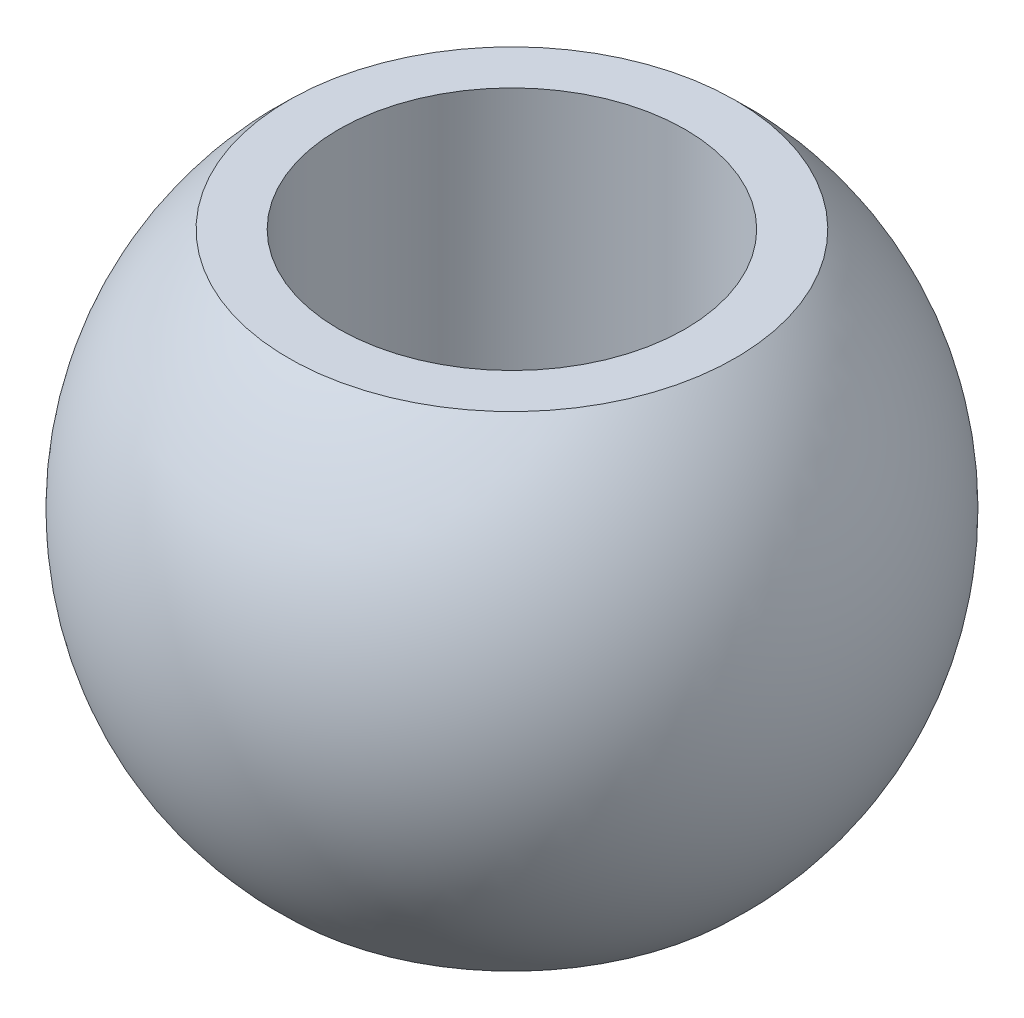
ISO-10303-21;
HEADER;
FILE_DESCRIPTION(('STEP AP214'),'2;1');
FILE_NAME('part.step','',(''),(''),'','','');
FILE_SCHEMA(('AUTOMOTIVE_DESIGN { 1 0 10303 214 1 1 1 1 }'));
ENDSEC;
DATA;
#1=APPLICATION_CONTEXT('core data for automotive mechanical design processes');
#2=APPLICATION_PROTOCOL_DEFINITION('international standard','automotive_design',2000,#1);
#3=PRODUCT_CONTEXT('',#1,'mechanical');
#4=PRODUCT('Part','Part','',(#3));
#5=PRODUCT_RELATED_PRODUCT_CATEGORY('part','',(#4));
#6=PRODUCT_DEFINITION_FORMATION('','',#4);
#7=PRODUCT_DEFINITION_CONTEXT('part definition',#1,'design');
#8=PRODUCT_DEFINITION('design','',#6,#7);
#9=PRODUCT_DEFINITION_SHAPE('','',#8);
#10=(LENGTH_UNIT() NAMED_UNIT(*) SI_UNIT(.MILLI.,.METRE.));
#11=(NAMED_UNIT(*) PLANE_ANGLE_UNIT() SI_UNIT($,.RADIAN.));
#12=(NAMED_UNIT(*) SI_UNIT($,.STERADIAN.) SOLID_ANGLE_UNIT());
#13=UNCERTAINTY_MEASURE_WITH_UNIT(LENGTH_MEASURE(1.E-05),#10,'distance_accuracy_value','');
#14=(GEOMETRIC_REPRESENTATION_CONTEXT(3) GLOBAL_UNCERTAINTY_ASSIGNED_CONTEXT((#13)) GLOBAL_UNIT_ASSIGNED_CONTEXT((#10,
#11,#12)) REPRESENTATION_CONTEXT('',''));
#15=CARTESIAN_POINT('',(0.,0.,0.));
#16=DIRECTION('',(0.,0.,1.));
#17=DIRECTION('',(1.,0.,0.));
#18=AXIS2_PLACEMENT_3D('',#15,#16,#17);
#19=CARTESIAN_POINT('',(5.,-7.,0.));
#20=DIRECTION('',(0.,-1.,0.));
#21=DIRECTION('',(0.,0.,-1.));
#22=AXIS2_PLACEMENT_3D('',#19,#20,#21);
#23=PLANE('',#22);
#24=CARTESIAN_POINT('',(0.,-7.,0.));
#25=DIRECTION('',(0.,-1.,0.));
#26=DIRECTION('',(0.,0.,-1.));
#27=AXIS2_PLACEMENT_3D('',#24,#25,#26);
#28=CIRCLE('',#27,6.45216242820963);
#29=CARTESIAN_POINT('',(0.,-7.,-6.45216242820963));
#30=VERTEX_POINT('',#29);
#31=EDGE_CURVE('E10',#30,#30,#28,.T.);
#32=ORIENTED_EDGE('',*,*,#31,.T.);
#33=EDGE_LOOP('',(#32));
#34=FACE_BOUND('',#33,.T.);
#35=CARTESIAN_POINT('',(0.,-7.,0.));
#36=DIRECTION('',(0.,-1.,0.));
#37=DIRECTION('',(0.,0.,-1.));
#38=AXIS2_PLACEMENT_3D('',#35,#36,#37);
#39=CIRCLE('',#38,5.);
#40=CARTESIAN_POINT('',(0.,-7.,-5.));
#41=VERTEX_POINT('',#40);
#42=EDGE_CURVE('E45',#41,#41,#39,.T.);
#43=ORIENTED_EDGE('',*,*,#42,.F.);
#44=EDGE_LOOP('',(#43));
#45=FACE_BOUND('',#44,.T.);
#46=ADVANCED_FACE('F31',(#34,#45),#23,.T.);
#47=CARTESIAN_POINT('',(0.,0.,0.));
#48=DIRECTION('',(0.,-1.,0.));
#49=DIRECTION('',(1.,0.,0.));
#50=AXIS2_PLACEMENT_3D('',#47,#48,#49);
#51=SPHERICAL_SURFACE('',#50,9.52);
#52=CARTESIAN_POINT('',(0.,7.,0.));
#53=DIRECTION('',(0.,-1.,0.));
#54=DIRECTION('',(0.,0.,-1.));
#55=AXIS2_PLACEMENT_3D('',#52,#53,#54);
#56=CIRCLE('',#55,6.45216242820963);
#57=CARTESIAN_POINT('',(0.,7.,-6.45216242820963));
#58=VERTEX_POINT('',#57);
#59=EDGE_CURVE('E37',#58,#58,#56,.T.);
#60=ORIENTED_EDGE('',*,*,#59,.T.);
#61=EDGE_LOOP('',(#60));
#62=FACE_BOUND('',#61,.T.);
#63=ORIENTED_EDGE('',*,*,#31,.F.);
#64=EDGE_LOOP('',(#63));
#65=FACE_BOUND('',#64,.T.);
#66=ADVANCED_FACE('F55',(#62,#65),#51,.T.);
#67=CARTESIAN_POINT('',(5.,7.,0.));
#68=DIRECTION('',(0.,1.,0.));
#69=DIRECTION('',(0.,0.,1.));
#70=AXIS2_PLACEMENT_3D('',#67,#68,#69);
#71=PLANE('',#70);
#72=CARTESIAN_POINT('',(0.,7.,0.));
#73=DIRECTION('',(0.,-1.,0.));
#74=DIRECTION('',(0.,0.,-1.));
#75=AXIS2_PLACEMENT_3D('',#72,#73,#74);
#76=CIRCLE('',#75,5.);
#77=CARTESIAN_POINT('',(0.,7.,-5.));
#78=VERTEX_POINT('',#77);
#79=EDGE_CURVE('E41',#78,#78,#76,.T.);
#80=ORIENTED_EDGE('',*,*,#79,.T.);
#81=EDGE_LOOP('',(#80));
#82=FACE_BOUND('',#81,.T.);
#83=ORIENTED_EDGE('',*,*,#59,.F.);
#84=EDGE_LOOP('',(#83));
#85=FACE_BOUND('',#84,.T.);
#86=ADVANCED_FACE('F59',(#82,#85),#71,.T.);
#87=CARTESIAN_POINT('',(0.,-11.1,0.));
#88=DIRECTION('',(0.,-1.,0.));
#89=DIRECTION('',(0.,0.,-1.));
#90=AXIS2_PLACEMENT_3D('',#87,#88,#89);
#91=CYLINDRICAL_SURFACE('',#90,5.);
#92=ORIENTED_EDGE('',*,*,#42,.T.);
#93=EDGE_LOOP('',(#92));
#94=FACE_BOUND('',#93,.T.);
#95=ORIENTED_EDGE('',*,*,#79,.F.);
#96=EDGE_LOOP('',(#95));
#97=FACE_BOUND('',#96,.T.);
#98=ADVANCED_FACE('F51',(#94,#97),#91,.F.);
#99=CLOSED_SHELL('',(#46,#66,#86,#98));
#100=MANIFOLD_SOLID_BREP('B2',#99);
#101=ADVANCED_BREP_SHAPE_REPRESENTATION('',(#18,#100),#14);
#102=SHAPE_DEFINITION_REPRESENTATION(#9,#101);
ENDSEC;
END-ISO-10303-21;
